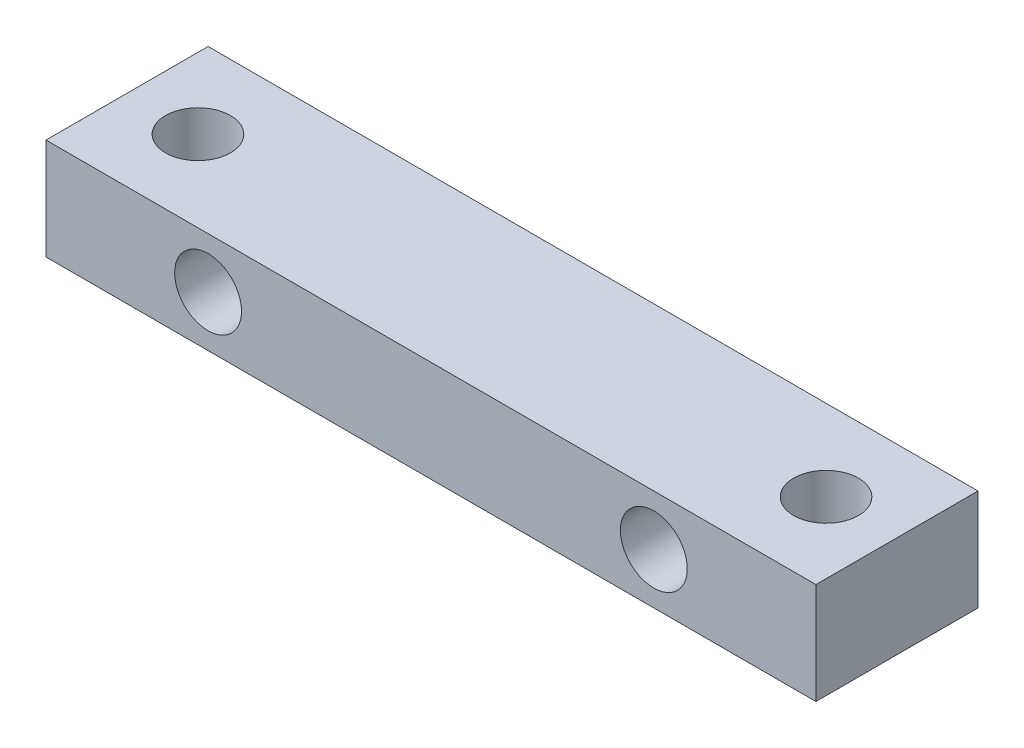
ISO-10303-21;
HEADER;
FILE_DESCRIPTION(('STEP AP214'),'2;1');
FILE_NAME('part.step','',(''),(''),'','','');
FILE_SCHEMA(('AUTOMOTIVE_DESIGN { 1 0 10303 214 1 1 1 1 }'));
ENDSEC;
DATA;
#1=APPLICATION_CONTEXT('core data for automotive mechanical design processes');
#2=APPLICATION_PROTOCOL_DEFINITION('international standard','automotive_design',2000,#1);
#3=PRODUCT_CONTEXT('',#1,'mechanical');
#4=PRODUCT('Part','Part','',(#3));
#5=PRODUCT_RELATED_PRODUCT_CATEGORY('part','',(#4));
#6=PRODUCT_DEFINITION_FORMATION('','',#4);
#7=PRODUCT_DEFINITION_CONTEXT('part definition',#1,'design');
#8=PRODUCT_DEFINITION('design','',#6,#7);
#9=PRODUCT_DEFINITION_SHAPE('','',#8);
#10=(LENGTH_UNIT() NAMED_UNIT(*) SI_UNIT(.MILLI.,.METRE.));
#11=(NAMED_UNIT(*) PLANE_ANGLE_UNIT() SI_UNIT($,.RADIAN.));
#12=(NAMED_UNIT(*) SI_UNIT($,.STERADIAN.) SOLID_ANGLE_UNIT());
#13=UNCERTAINTY_MEASURE_WITH_UNIT(LENGTH_MEASURE(1.E-05),#10,'distance_accuracy_value','');
#14=(GEOMETRIC_REPRESENTATION_CONTEXT(3) GLOBAL_UNCERTAINTY_ASSIGNED_CONTEXT((#13)) GLOBAL_UNIT_ASSIGNED_CONTEXT((#10,
#11,#12)) REPRESENTATION_CONTEXT('',''));
#15=CARTESIAN_POINT('',(0.,0.,0.));
#16=DIRECTION('',(0.,0.,1.));
#17=DIRECTION('',(1.,0.,0.));
#18=AXIS2_PLACEMENT_3D('',#15,#16,#17);
#19=CARTESIAN_POINT('',(0.,0.,8.));
#20=DIRECTION('',(1.,0.,0.));
#21=DIRECTION('',(0.,0.,-1.));
#22=AXIS2_PLACEMENT_3D('',#19,#20,#21);
#23=PLANE('',#22);
#24=DIRECTION('',(0.,-1.,0.));
#25=VECTOR('',#24,1.);
#26=CARTESIAN_POINT('',(0.,0.,0.));
#27=LINE('',#26,#25);
#28=CARTESIAN_POINT('',(0.,5.,0.));
#29=VERTEX_POINT('',#28);
#30=CARTESIAN_POINT('',(0.,0.,0.));
#31=VERTEX_POINT('',#30);
#32=EDGE_CURVE('E99',#29,#31,#27,.T.);
#33=ORIENTED_EDGE('',*,*,#32,.T.);
#34=DIRECTION('',(0.,0.,-1.));
#35=VECTOR('',#34,1.);
#36=CARTESIAN_POINT('',(0.,0.,8.));
#37=LINE('',#36,#35);
#38=CARTESIAN_POINT('',(0.,0.,8.));
#39=VERTEX_POINT('',#38);
#40=EDGE_CURVE('E11',#39,#31,#37,.T.);
#41=ORIENTED_EDGE('',*,*,#40,.F.);
#42=DIRECTION('',(0.,-1.,0.));
#43=VECTOR('',#42,1.);
#44=CARTESIAN_POINT('',(0.,0.,8.));
#45=LINE('',#44,#43);
#46=CARTESIAN_POINT('',(0.,5.,8.));
#47=VERTEX_POINT('',#46);
#48=EDGE_CURVE('E87',#47,#39,#45,.T.);
#49=ORIENTED_EDGE('',*,*,#48,.F.);
#50=DIRECTION('',(0.,0.,-1.));
#51=VECTOR('',#50,1.);
#52=CARTESIAN_POINT('',(0.,5.,8.));
#53=LINE('',#52,#51);
#54=EDGE_CURVE('E95',#47,#29,#53,.T.);
#55=ORIENTED_EDGE('',*,*,#54,.T.);
#56=EDGE_LOOP('',(#33,#41,#49,#55));
#57=FACE_BOUND('',#56,.T.);
#58=ADVANCED_FACE('F36',(#57),#23,.F.);
#59=CARTESIAN_POINT('',(0.,0.,8.));
#60=DIRECTION('',(0.,1.,0.));
#61=DIRECTION('',(0.,0.,1.));
#62=AXIS2_PLACEMENT_3D('',#59,#60,#61);
#63=PLANE('',#62);
#64=CARTESIAN_POINT('',(3.5,0.,4.));
#65=DIRECTION('',(0.,1.,0.));
#66=DIRECTION('',(0.,0.,1.));
#67=AXIS2_PLACEMENT_3D('',#64,#65,#66);
#68=CIRCLE('',#67,1.59999999999999);
#69=CARTESIAN_POINT('',(3.5,0.,5.59999999999999));
#70=VERTEX_POINT('',#69);
#71=EDGE_CURVE('E118',#70,#70,#68,.T.);
#72=ORIENTED_EDGE('',*,*,#71,.T.);
#73=EDGE_LOOP('',(#72));
#74=FACE_BOUND('',#73,.T.);
#75=CARTESIAN_POINT('',(34.5,0.,4.));
#76=DIRECTION('',(0.,1.,0.));
#77=DIRECTION('',(0.,0.,1.));
#78=AXIS2_PLACEMENT_3D('',#75,#76,#77);
#79=CIRCLE('',#78,1.59999999999999);
#80=CARTESIAN_POINT('',(34.5,0.,5.59999999999999));
#81=VERTEX_POINT('',#80);
#82=EDGE_CURVE('E102',#81,#81,#79,.T.);
#83=ORIENTED_EDGE('',*,*,#82,.T.);
#84=EDGE_LOOP('',(#83));
#85=FACE_BOUND('',#84,.T.);
#86=DIRECTION('',(1.,0.,0.));
#87=VECTOR('',#86,1.);
#88=CARTESIAN_POINT('',(0.,0.,0.));
#89=LINE('',#88,#87);
#90=CARTESIAN_POINT('',(38.,0.,0.));
#91=VERTEX_POINT('',#90);
#92=EDGE_CURVE('E91',#31,#91,#89,.T.);
#93=ORIENTED_EDGE('',*,*,#92,.T.);
#94=DIRECTION('',(0.,0.,-1.));
#95=VECTOR('',#94,1.);
#96=CARTESIAN_POINT('',(38.,0.,8.));
#97=LINE('',#96,#95);
#98=CARTESIAN_POINT('',(38.,0.,8.));
#99=VERTEX_POINT('',#98);
#100=EDGE_CURVE('E44',#99,#91,#97,.T.);
#101=ORIENTED_EDGE('',*,*,#100,.F.);
#102=DIRECTION('',(1.,0.,0.));
#103=VECTOR('',#102,1.);
#104=CARTESIAN_POINT('',(0.,0.,8.));
#105=LINE('',#104,#103);
#106=EDGE_CURVE('E82',#39,#99,#105,.T.);
#107=ORIENTED_EDGE('',*,*,#106,.F.);
#108=ORIENTED_EDGE('',*,*,#40,.T.);
#109=EDGE_LOOP('',(#93,#101,#107,#108));
#110=FACE_BOUND('',#109,.T.);
#111=ADVANCED_FACE('F90',(#74,#85,#110),#63,.F.);
#112=CARTESIAN_POINT('',(38.,0.,8.));
#113=DIRECTION('',(-1.,0.,0.));
#114=DIRECTION('',(0.,0.,1.));
#115=AXIS2_PLACEMENT_3D('',#112,#113,#114);
#116=PLANE('',#115);
#117=DIRECTION('',(0.,1.,0.));
#118=VECTOR('',#117,1.);
#119=CARTESIAN_POINT('',(38.,0.,0.));
#120=LINE('',#119,#118);
#121=CARTESIAN_POINT('',(38.,5.,0.));
#122=VERTEX_POINT('',#121);
#123=EDGE_CURVE('E69',#91,#122,#120,.T.);
#124=ORIENTED_EDGE('',*,*,#123,.T.);
#125=DIRECTION('',(0.,0.,-1.));
#126=VECTOR('',#125,1.);
#127=CARTESIAN_POINT('',(38.,5.,8.));
#128=LINE('',#127,#126);
#129=CARTESIAN_POINT('',(38.,5.,8.));
#130=VERTEX_POINT('',#129);
#131=EDGE_CURVE('E92',#130,#122,#128,.T.);
#132=ORIENTED_EDGE('',*,*,#131,.F.);
#133=DIRECTION('',(0.,1.,0.));
#134=VECTOR('',#133,1.);
#135=CARTESIAN_POINT('',(38.,0.,8.));
#136=LINE('',#135,#134);
#137=EDGE_CURVE('E85',#99,#130,#136,.T.);
#138=ORIENTED_EDGE('',*,*,#137,.F.);
#139=ORIENTED_EDGE('',*,*,#100,.T.);
#140=EDGE_LOOP('',(#124,#132,#138,#139));
#141=FACE_BOUND('',#140,.T.);
#142=ADVANCED_FACE('F93',(#141),#116,.F.);
#143=CARTESIAN_POINT('',(0.,5.,8.));
#144=DIRECTION('',(0.,-1.,0.));
#145=DIRECTION('',(0.,0.,-1.));
#146=AXIS2_PLACEMENT_3D('',#143,#144,#145);
#147=PLANE('',#146);
#148=CARTESIAN_POINT('',(3.5,5.,4.));
#149=DIRECTION('',(0.,1.,0.));
#150=DIRECTION('',(0.,0.,1.));
#151=AXIS2_PLACEMENT_3D('',#148,#149,#150);
#152=CIRCLE('',#151,1.59999999999999);
#153=CARTESIAN_POINT('',(3.5,5.,5.59999999999999));
#154=VERTEX_POINT('',#153);
#155=EDGE_CURVE('E121',#154,#154,#152,.T.);
#156=ORIENTED_EDGE('',*,*,#155,.F.);
#157=EDGE_LOOP('',(#156));
#158=FACE_BOUND('',#157,.T.);
#159=CARTESIAN_POINT('',(34.5,5.,4.));
#160=DIRECTION('',(0.,1.,0.));
#161=DIRECTION('',(0.,0.,1.));
#162=AXIS2_PLACEMENT_3D('',#159,#160,#161);
#163=CIRCLE('',#162,1.59999999999999);
#164=CARTESIAN_POINT('',(34.5,5.,5.59999999999999));
#165=VERTEX_POINT('',#164);
#166=EDGE_CURVE('E115',#165,#165,#163,.T.);
#167=ORIENTED_EDGE('',*,*,#166,.F.);
#168=EDGE_LOOP('',(#167));
#169=FACE_BOUND('',#168,.T.);
#170=DIRECTION('',(-1.,0.,0.));
#171=VECTOR('',#170,1.);
#172=CARTESIAN_POINT('',(0.,5.,0.));
#173=LINE('',#172,#171);
#174=EDGE_CURVE('E75',#122,#29,#173,.T.);
#175=ORIENTED_EDGE('',*,*,#174,.T.);
#176=ORIENTED_EDGE('',*,*,#54,.F.);
#177=DIRECTION('',(-1.,0.,0.));
#178=VECTOR('',#177,1.);
#179=CARTESIAN_POINT('',(0.,5.,8.));
#180=LINE('',#179,#178);
#181=EDGE_CURVE('E52',#130,#47,#180,.T.);
#182=ORIENTED_EDGE('',*,*,#181,.F.);
#183=ORIENTED_EDGE('',*,*,#131,.T.);
#184=EDGE_LOOP('',(#175,#176,#182,#183));
#185=FACE_BOUND('',#184,.T.);
#186=ADVANCED_FACE('F107',(#158,#169,#185),#147,.F.);
#187=CARTESIAN_POINT('',(0.,0.,8.));
#188=DIRECTION('',(0.,0.,-1.));
#189=DIRECTION('',(-1.,0.,0.));
#190=AXIS2_PLACEMENT_3D('',#187,#188,#189);
#191=PLANE('',#190);
#192=CARTESIAN_POINT('',(8.,2.5,8.));
#193=DIRECTION('',(0.,0.,-1.));
#194=DIRECTION('',(-1.,0.,0.));
#195=AXIS2_PLACEMENT_3D('',#192,#193,#194);
#196=CIRCLE('',#195,1.64999999999999);
#197=CARTESIAN_POINT('',(6.35,2.5,8.));
#198=VERTEX_POINT('',#197);
#199=EDGE_CURVE('E130',#198,#198,#196,.T.);
#200=ORIENTED_EDGE('',*,*,#199,.T.);
#201=EDGE_LOOP('',(#200));
#202=FACE_BOUND('',#201,.T.);
#203=CARTESIAN_POINT('',(30.,2.5,8.));
#204=DIRECTION('',(0.,0.,-1.));
#205=DIRECTION('',(-1.,0.,0.));
#206=AXIS2_PLACEMENT_3D('',#203,#204,#205);
#207=CIRCLE('',#206,1.64999999999999);
#208=CARTESIAN_POINT('',(28.35,2.5,8.));
#209=VERTEX_POINT('',#208);
#210=EDGE_CURVE('E124',#209,#209,#207,.T.);
#211=ORIENTED_EDGE('',*,*,#210,.T.);
#212=EDGE_LOOP('',(#211));
#213=FACE_BOUND('',#212,.T.);
#214=ORIENTED_EDGE('',*,*,#48,.T.);
#215=ORIENTED_EDGE('',*,*,#106,.T.);
#216=ORIENTED_EDGE('',*,*,#137,.T.);
#217=ORIENTED_EDGE('',*,*,#181,.T.);
#218=EDGE_LOOP('',(#214,#215,#216,#217));
#219=FACE_BOUND('',#218,.T.);
#220=ADVANCED_FACE('F83',(#202,#213,#219),#191,.F.);
#221=CARTESIAN_POINT('',(0.,0.,0.));
#222=DIRECTION('',(0.,0.,-1.));
#223=DIRECTION('',(-1.,0.,0.));
#224=AXIS2_PLACEMENT_3D('',#221,#222,#223);
#225=PLANE('',#224);
#226=CARTESIAN_POINT('',(8.,2.5,0.));
#227=DIRECTION('',(0.,0.,-1.));
#228=DIRECTION('',(-1.,0.,0.));
#229=AXIS2_PLACEMENT_3D('',#226,#227,#228);
#230=CIRCLE('',#229,1.64999999999999);
#231=CARTESIAN_POINT('',(6.35000000000001,2.5,0.));
#232=VERTEX_POINT('',#231);
#233=EDGE_CURVE('E133',#232,#232,#230,.T.);
#234=ORIENTED_EDGE('',*,*,#233,.F.);
#235=EDGE_LOOP('',(#234));
#236=FACE_BOUND('',#235,.T.);
#237=CARTESIAN_POINT('',(30.,2.5,0.));
#238=DIRECTION('',(0.,0.,-1.));
#239=DIRECTION('',(-1.,0.,0.));
#240=AXIS2_PLACEMENT_3D('',#237,#238,#239);
#241=CIRCLE('',#240,1.64999999999999);
#242=CARTESIAN_POINT('',(28.35,2.5,0.));
#243=VERTEX_POINT('',#242);
#244=EDGE_CURVE('E127',#243,#243,#241,.T.);
#245=ORIENTED_EDGE('',*,*,#244,.F.);
#246=EDGE_LOOP('',(#245));
#247=FACE_BOUND('',#246,.T.);
#248=ORIENTED_EDGE('',*,*,#32,.F.);
#249=ORIENTED_EDGE('',*,*,#174,.F.);
#250=ORIENTED_EDGE('',*,*,#123,.F.);
#251=ORIENTED_EDGE('',*,*,#92,.F.);
#252=EDGE_LOOP('',(#248,#249,#250,#251));
#253=FACE_BOUND('',#252,.T.);
#254=ADVANCED_FACE('F110',(#236,#247,#253),#225,.T.);
#255=CARTESIAN_POINT('',(34.5,5.,4.));
#256=DIRECTION('',(0.,1.,0.));
#257=DIRECTION('',(0.,0.,1.));
#258=AXIS2_PLACEMENT_3D('',#255,#256,#257);
#259=CYLINDRICAL_SURFACE('',#258,1.59999999999999);
#260=ORIENTED_EDGE('',*,*,#166,.T.);
#261=EDGE_LOOP('',(#260));
#262=FACE_BOUND('',#261,.T.);
#263=ORIENTED_EDGE('',*,*,#82,.F.);
#264=EDGE_LOOP('',(#263));
#265=FACE_BOUND('',#264,.T.);
#266=ADVANCED_FACE('F141',(#262,#265),#259,.F.);
#267=CARTESIAN_POINT('',(3.5,5.,4.));
#268=DIRECTION('',(0.,1.,0.));
#269=DIRECTION('',(0.,0.,1.));
#270=AXIS2_PLACEMENT_3D('',#267,#268,#269);
#271=CYLINDRICAL_SURFACE('',#270,1.59999999999999);
#272=ORIENTED_EDGE('',*,*,#155,.T.);
#273=EDGE_LOOP('',(#272));
#274=FACE_BOUND('',#273,.T.);
#275=ORIENTED_EDGE('',*,*,#71,.F.);
#276=EDGE_LOOP('',(#275));
#277=FACE_BOUND('',#276,.T.);
#278=ADVANCED_FACE('F147',(#274,#277),#271,.F.);
#279=CARTESIAN_POINT('',(30.,2.5,0.));
#280=DIRECTION('',(0.,0.,-1.));
#281=DIRECTION('',(-1.,0.,0.));
#282=AXIS2_PLACEMENT_3D('',#279,#280,#281);
#283=CYLINDRICAL_SURFACE('',#282,1.64999999999999);
#284=ORIENTED_EDGE('',*,*,#210,.F.);
#285=EDGE_LOOP('',(#284));
#286=FACE_BOUND('',#285,.T.);
#287=ORIENTED_EDGE('',*,*,#244,.T.);
#288=EDGE_LOOP('',(#287));
#289=FACE_BOUND('',#288,.T.);
#290=ADVANCED_FACE('F145',(#286,#289),#283,.F.);
#291=CARTESIAN_POINT('',(8.,2.5,0.));
#292=DIRECTION('',(0.,0.,-1.));
#293=DIRECTION('',(-1.,0.,0.));
#294=AXIS2_PLACEMENT_3D('',#291,#292,#293);
#295=CYLINDRICAL_SURFACE('',#294,1.64999999999999);
#296=ORIENTED_EDGE('',*,*,#199,.F.);
#297=EDGE_LOOP('',(#296));
#298=FACE_BOUND('',#297,.T.);
#299=ORIENTED_EDGE('',*,*,#233,.T.);
#300=EDGE_LOOP('',(#299));
#301=FACE_BOUND('',#300,.T.);
#302=ADVANCED_FACE('F137',(#298,#301),#295,.F.);
#303=CLOSED_SHELL('',(#58,#111,#142,#186,#220,#254,#266,#278,#290,#302));
#304=MANIFOLD_SOLID_BREP('B2',#303);
#305=ADVANCED_BREP_SHAPE_REPRESENTATION('',(#18,#304),#14);
#306=SHAPE_DEFINITION_REPRESENTATION(#9,#305);
ENDSEC;
END-ISO-10303-21;
